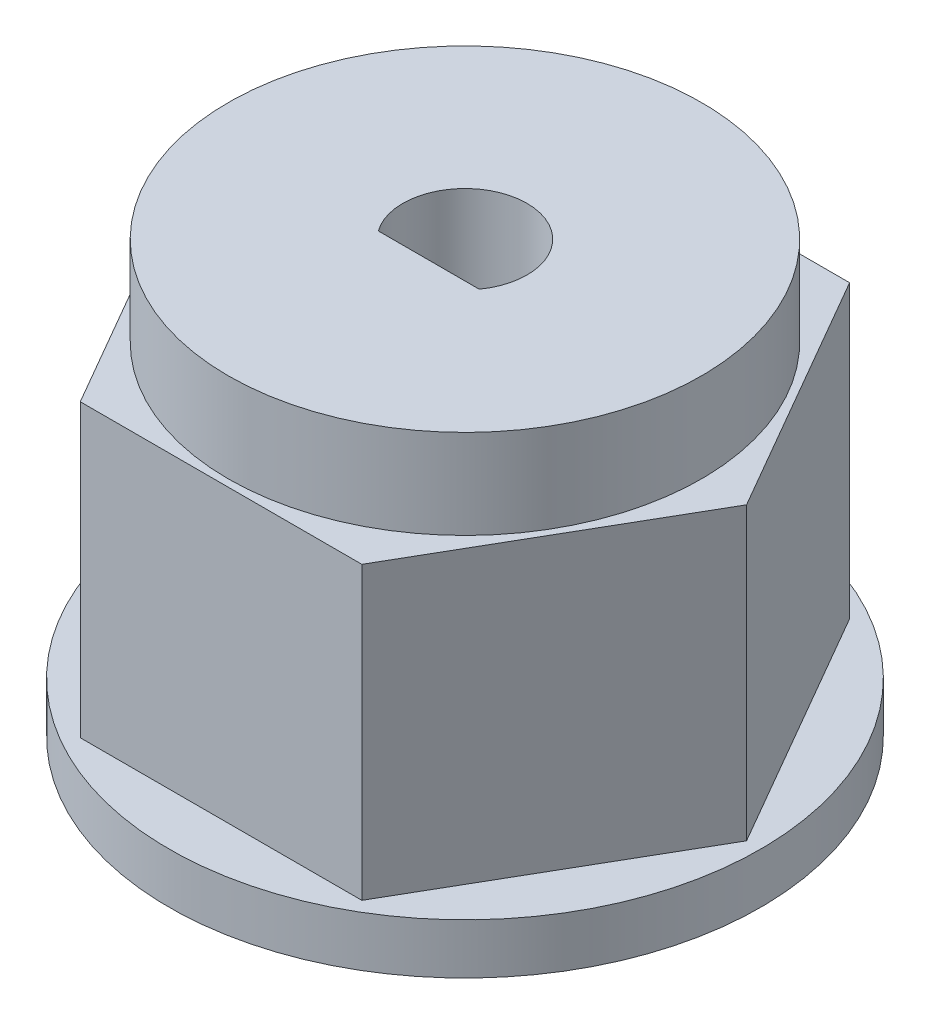
ISO-10303-21;
HEADER;
FILE_DESCRIPTION(('STEP AP214'),'2;1');
FILE_NAME('part.step','',(''),(''),'','','');
FILE_SCHEMA(('AUTOMOTIVE_DESIGN { 1 0 10303 214 1 1 1 1 }'));
ENDSEC;
DATA;
#1=APPLICATION_CONTEXT('core data for automotive mechanical design processes');
#2=APPLICATION_PROTOCOL_DEFINITION('international standard','automotive_design',2000,#1);
#3=PRODUCT_CONTEXT('',#1,'mechanical');
#4=PRODUCT('Part','Part','',(#3));
#5=PRODUCT_RELATED_PRODUCT_CATEGORY('part','',(#4));
#6=PRODUCT_DEFINITION_FORMATION('','',#4);
#7=PRODUCT_DEFINITION_CONTEXT('part definition',#1,'design');
#8=PRODUCT_DEFINITION('design','',#6,#7);
#9=PRODUCT_DEFINITION_SHAPE('','',#8);
#10=(LENGTH_UNIT() NAMED_UNIT(*) SI_UNIT(.MILLI.,.METRE.));
#11=(NAMED_UNIT(*) PLANE_ANGLE_UNIT() SI_UNIT($,.RADIAN.));
#12=(NAMED_UNIT(*) SI_UNIT($,.STERADIAN.) SOLID_ANGLE_UNIT());
#13=UNCERTAINTY_MEASURE_WITH_UNIT(LENGTH_MEASURE(1.E-05),#10,'distance_accuracy_value','');
#14=(GEOMETRIC_REPRESENTATION_CONTEXT(3) GLOBAL_UNCERTAINTY_ASSIGNED_CONTEXT((#13)) GLOBAL_UNIT_ASSIGNED_CONTEXT((#10,
#11,#12)) REPRESENTATION_CONTEXT('',''));
#15=CARTESIAN_POINT('',(0.,0.,0.));
#16=DIRECTION('',(0.,0.,1.));
#17=DIRECTION('',(1.,0.,0.));
#18=AXIS2_PLACEMENT_3D('',#15,#16,#17);
#19=CARTESIAN_POINT('',(3.62864644185677,7.5,6.28499999999993));
#20=DIRECTION('',(-0.866025403784439,0.,-0.5));
#21=DIRECTION('',(-0.5,0.,0.866025403784439));
#22=AXIS2_PLACEMENT_3D('',#19,#20,#21);
#23=PLANE('',#22);
#24=DIRECTION('',(0.5,0.,-0.866025403784439));
#25=VECTOR('',#24,1.);
#26=CARTESIAN_POINT('',(3.62864644185677,0.,6.28499999999993));
#27=LINE('',#26,#25);
#28=CARTESIAN_POINT('',(3.62864644185677,0.,6.28499999999993));
#29=VERTEX_POINT('',#28);
#30=CARTESIAN_POINT('',(7.25729288371349,0.,0.));
#31=VERTEX_POINT('',#30);
#32=EDGE_CURVE('E123',#29,#31,#27,.T.);
#33=ORIENTED_EDGE('',*,*,#32,.T.);
#34=DIRECTION('',(0.,-1.,0.));
#35=VECTOR('',#34,1.);
#36=CARTESIAN_POINT('',(7.25729288371349,7.5,0.));
#37=LINE('',#36,#35);
#38=CARTESIAN_POINT('',(7.25729288371349,7.5,0.));
#39=VERTEX_POINT('',#38);
#40=EDGE_CURVE('E36',#39,#31,#37,.T.);
#41=ORIENTED_EDGE('',*,*,#40,.F.);
#42=DIRECTION('',(0.5,0.,-0.866025403784439));
#43=VECTOR('',#42,1.);
#44=CARTESIAN_POINT('',(3.62864644185677,7.5,6.28499999999993));
#45=LINE('',#44,#43);
#46=CARTESIAN_POINT('',(3.62864644185677,7.5,6.28499999999993));
#47=VERTEX_POINT('',#46);
#48=EDGE_CURVE('E125',#47,#39,#45,.T.);
#49=ORIENTED_EDGE('',*,*,#48,.F.);
#50=DIRECTION('',(0.,-1.,0.));
#51=VECTOR('',#50,1.);
#52=CARTESIAN_POINT('',(3.62864644185677,7.5,6.28499999999993));
#53=LINE('',#52,#51);
#54=EDGE_CURVE('E139',#47,#29,#53,.T.);
#55=ORIENTED_EDGE('',*,*,#54,.T.);
#56=EDGE_LOOP('',(#33,#41,#49,#55));
#57=FACE_BOUND('',#56,.T.);
#58=ADVANCED_FACE('F33',(#57),#23,.F.);
#59=CARTESIAN_POINT('',(7.25729288371349,7.5,0.));
#60=DIRECTION('',(-0.866025403784439,0.,0.5));
#61=DIRECTION('',(0.5,0.,0.866025403784439));
#62=AXIS2_PLACEMENT_3D('',#59,#60,#61);
#63=PLANE('',#62);
#64=DIRECTION('',(-0.5,0.,-0.866025403784439));
#65=VECTOR('',#64,1.);
#66=CARTESIAN_POINT('',(7.25729288371349,0.,0.));
#67=LINE('',#66,#65);
#68=CARTESIAN_POINT('',(3.62864644185665,0.,-6.28500000000001));
#69=VERTEX_POINT('',#68);
#70=EDGE_CURVE('E142',#31,#69,#67,.T.);
#71=ORIENTED_EDGE('',*,*,#70,.T.);
#72=DIRECTION('',(0.,-1.,0.));
#73=VECTOR('',#72,1.);
#74=CARTESIAN_POINT('',(3.62864644185665,7.5,-6.28500000000001));
#75=LINE('',#74,#73);
#76=CARTESIAN_POINT('',(3.62864644185665,7.5,-6.28500000000001));
#77=VERTEX_POINT('',#76);
#78=EDGE_CURVE('E166',#77,#69,#75,.T.);
#79=ORIENTED_EDGE('',*,*,#78,.F.);
#80=DIRECTION('',(-0.5,0.,-0.866025403784439));
#81=VECTOR('',#80,1.);
#82=CARTESIAN_POINT('',(7.25729288371349,7.5,0.));
#83=LINE('',#82,#81);
#84=EDGE_CURVE('E128',#39,#77,#83,.T.);
#85=ORIENTED_EDGE('',*,*,#84,.F.);
#86=ORIENTED_EDGE('',*,*,#40,.T.);
#87=EDGE_LOOP('',(#71,#79,#85,#86));
#88=FACE_BOUND('',#87,.T.);
#89=ADVANCED_FACE('F174',(#88),#63,.F.);
#90=CARTESIAN_POINT('',(3.62864644185665,7.5,-6.28500000000001));
#91=DIRECTION('',(0.,0.,1.));
#92=DIRECTION('',(1.,0.,0.));
#93=AXIS2_PLACEMENT_3D('',#90,#91,#92);
#94=PLANE('',#93);
#95=DIRECTION('',(-1.,0.,0.));
#96=VECTOR('',#95,1.);
#97=CARTESIAN_POINT('',(3.62864644185665,0.,-6.28500000000001));
#98=LINE('',#97,#96);
#99=CARTESIAN_POINT('',(-3.62864644185681,0.,-6.28500000000001));
#100=VERTEX_POINT('',#99);
#101=EDGE_CURVE('E145',#69,#100,#98,.T.);
#102=ORIENTED_EDGE('',*,*,#101,.T.);
#103=DIRECTION('',(0.,-1.,0.));
#104=VECTOR('',#103,1.);
#105=CARTESIAN_POINT('',(-3.62864644185681,7.5,-6.28500000000001));
#106=LINE('',#105,#104);
#107=CARTESIAN_POINT('',(-3.62864644185681,7.5,-6.28500000000001));
#108=VERTEX_POINT('',#107);
#109=EDGE_CURVE('E164',#108,#100,#106,.T.);
#110=ORIENTED_EDGE('',*,*,#109,.F.);
#111=DIRECTION('',(-1.,0.,0.));
#112=VECTOR('',#111,1.);
#113=CARTESIAN_POINT('',(3.62864644185665,7.5,-6.28500000000001));
#114=LINE('',#113,#112);
#115=EDGE_CURVE('E131',#77,#108,#114,.T.);
#116=ORIENTED_EDGE('',*,*,#115,.F.);
#117=ORIENTED_EDGE('',*,*,#78,.T.);
#118=EDGE_LOOP('',(#102,#110,#116,#117));
#119=FACE_BOUND('',#118,.T.);
#120=ADVANCED_FACE('F193',(#119),#94,.F.);
#121=CARTESIAN_POINT('',(-3.62864644185681,7.5,-6.28500000000001));
#122=DIRECTION('',(0.866025403784438,0.,0.500000000000001));
#123=DIRECTION('',(0.500000000000001,0.,-0.866025403784438));
#124=AXIS2_PLACEMENT_3D('',#121,#122,#123);
#125=PLANE('',#124);
#126=DIRECTION('',(-0.500000000000001,0.,0.866025403784438));
#127=VECTOR('',#126,1.);
#128=CARTESIAN_POINT('',(-3.62864644185681,0.,-6.28500000000001));
#129=LINE('',#128,#127);
#130=CARTESIAN_POINT('',(-7.25729288371363,0.,0.));
#131=VERTEX_POINT('',#130);
#132=EDGE_CURVE('E148',#100,#131,#129,.T.);
#133=ORIENTED_EDGE('',*,*,#132,.T.);
#134=DIRECTION('',(0.,-1.,0.));
#135=VECTOR('',#134,1.);
#136=CARTESIAN_POINT('',(-7.25729288371363,7.5,0.));
#137=LINE('',#136,#135);
#138=CARTESIAN_POINT('',(-7.25729288371363,7.5,0.));
#139=VERTEX_POINT('',#138);
#140=EDGE_CURVE('E161',#139,#131,#137,.T.);
#141=ORIENTED_EDGE('',*,*,#140,.F.);
#142=DIRECTION('',(-0.500000000000001,0.,0.866025403784438));
#143=VECTOR('',#142,1.);
#144=CARTESIAN_POINT('',(-3.62864644185681,7.5,-6.28500000000001));
#145=LINE('',#144,#143);
#146=EDGE_CURVE('E133',#108,#139,#145,.T.);
#147=ORIENTED_EDGE('',*,*,#146,.F.);
#148=ORIENTED_EDGE('',*,*,#109,.T.);
#149=EDGE_LOOP('',(#133,#141,#147,#148));
#150=FACE_BOUND('',#149,.T.);
#151=ADVANCED_FACE('F190',(#150),#125,.F.);
#152=CARTESIAN_POINT('',(-7.25729288371363,7.5,0.));
#153=DIRECTION('',(0.866025403784439,0.,-0.499999999999999));
#154=DIRECTION('',(-0.499999999999999,0.,-0.866025403784439));
#155=AXIS2_PLACEMENT_3D('',#152,#153,#154);
#156=PLANE('',#155);
#157=DIRECTION('',(0.499999999999999,0.,0.866025403784439));
#158=VECTOR('',#157,1.);
#159=CARTESIAN_POINT('',(-7.25729288371363,0.,0.));
#160=LINE('',#159,#158);
#161=CARTESIAN_POINT('',(-3.62864644185686,0.,6.28499999999996));
#162=VERTEX_POINT('',#161);
#163=EDGE_CURVE('E151',#131,#162,#160,.T.);
#164=ORIENTED_EDGE('',*,*,#163,.T.);
#165=DIRECTION('',(0.,-1.,0.));
#166=VECTOR('',#165,1.);
#167=CARTESIAN_POINT('',(-3.62864644185686,7.5,6.28499999999996));
#168=LINE('',#167,#166);
#169=CARTESIAN_POINT('',(-3.62864644185686,7.5,6.28499999999996));
#170=VERTEX_POINT('',#169);
#171=EDGE_CURVE('E158',#170,#162,#168,.T.);
#172=ORIENTED_EDGE('',*,*,#171,.F.);
#173=DIRECTION('',(0.499999999999999,0.,0.866025403784439));
#174=VECTOR('',#173,1.);
#175=CARTESIAN_POINT('',(-7.25729288371363,7.5,0.));
#176=LINE('',#175,#174);
#177=EDGE_CURVE('E135',#139,#170,#176,.T.);
#178=ORIENTED_EDGE('',*,*,#177,.F.);
#179=ORIENTED_EDGE('',*,*,#140,.T.);
#180=EDGE_LOOP('',(#164,#172,#178,#179));
#181=FACE_BOUND('',#180,.T.);
#182=ADVANCED_FACE('F187',(#181),#156,.F.);
#183=CARTESIAN_POINT('',(-3.62864644185686,7.5,6.28499999999996));
#184=DIRECTION('',(0.,0.,-1.));
#185=DIRECTION('',(-1.,0.,0.));
#186=AXIS2_PLACEMENT_3D('',#183,#184,#185);
#187=PLANE('',#186);
#188=DIRECTION('',(1.,0.,0.));
#189=VECTOR('',#188,1.);
#190=CARTESIAN_POINT('',(-3.62864644185686,0.,6.28499999999996));
#191=LINE('',#190,#189);
#192=EDGE_CURVE('E129',#162,#29,#191,.T.);
#193=ORIENTED_EDGE('',*,*,#192,.T.);
#194=ORIENTED_EDGE('',*,*,#54,.F.);
#195=DIRECTION('',(1.,0.,0.));
#196=VECTOR('',#195,1.);
#197=CARTESIAN_POINT('',(-3.62864644185686,7.5,6.28499999999996));
#198=LINE('',#197,#196);
#199=EDGE_CURVE('E137',#170,#47,#198,.T.);
#200=ORIENTED_EDGE('',*,*,#199,.F.);
#201=ORIENTED_EDGE('',*,*,#171,.T.);
#202=EDGE_LOOP('',(#193,#194,#200,#201));
#203=FACE_BOUND('',#202,.T.);
#204=ADVANCED_FACE('F182',(#203),#187,.F.);
#205=CARTESIAN_POINT('',(0.,7.5,0.));
#206=DIRECTION('',(0.,1.,0.));
#207=DIRECTION('',(0.,0.,1.));
#208=AXIS2_PLACEMENT_3D('',#205,#206,#207);
#209=PLANE('',#208);
#210=CARTESIAN_POINT('',(0.,7.5,0.));
#211=DIRECTION('',(0.,1.,0.));
#212=DIRECTION('',(0.,0.,1.));
#213=AXIS2_PLACEMENT_3D('',#210,#211,#212);
#214=CIRCLE('',#213,6.1);
#215=CARTESIAN_POINT('',(0.,7.5,6.1));
#216=VERTEX_POINT('',#215);
#217=EDGE_CURVE('E11',#216,#216,#214,.T.);
#218=ORIENTED_EDGE('',*,*,#217,.F.);
#219=EDGE_LOOP('',(#218));
#220=FACE_BOUND('',#219,.T.);
#221=ORIENTED_EDGE('',*,*,#48,.T.);
#222=ORIENTED_EDGE('',*,*,#84,.T.);
#223=ORIENTED_EDGE('',*,*,#115,.T.);
#224=ORIENTED_EDGE('',*,*,#146,.T.);
#225=ORIENTED_EDGE('',*,*,#177,.T.);
#226=ORIENTED_EDGE('',*,*,#199,.T.);
#227=EDGE_LOOP('',(#221,#222,#223,#224,#225,#226));
#228=FACE_BOUND('',#227,.T.);
#229=ADVANCED_FACE('F195',(#220,#228),#209,.T.);
#230=CARTESIAN_POINT('',(0.,9.8,0.));
#231=DIRECTION('',(0.,-1.,0.));
#232=DIRECTION('',(0.,0.,-1.));
#233=AXIS2_PLACEMENT_3D('',#230,#231,#232);
#234=CYLINDRICAL_SURFACE('',#233,6.1);
#235=CARTESIAN_POINT('',(0.,9.8,0.));
#236=DIRECTION('',(0.,1.,0.));
#237=DIRECTION('',(0.,0.,1.));
#238=AXIS2_PLACEMENT_3D('',#235,#236,#237);
#239=CIRCLE('',#238,6.1);
#240=CARTESIAN_POINT('',(0.,9.8,6.1));
#241=VERTEX_POINT('',#240);
#242=EDGE_CURVE('E119',#241,#241,#239,.T.);
#243=ORIENTED_EDGE('',*,*,#242,.F.);
#244=EDGE_LOOP('',(#243));
#245=FACE_BOUND('',#244,.T.);
#246=ORIENTED_EDGE('',*,*,#217,.T.);
#247=EDGE_LOOP('',(#246));
#248=FACE_BOUND('',#247,.T.);
#249=ADVANCED_FACE('F197',(#245,#248),#234,.T.);
#250=CARTESIAN_POINT('',(0.,9.8,0.));
#251=DIRECTION('',(0.,1.,0.));
#252=DIRECTION('',(0.,0.,1.));
#253=AXIS2_PLACEMENT_3D('',#250,#251,#252);
#254=PLANE('',#253);
#255=CARTESIAN_POINT('',(0.,9.8,0.));
#256=DIRECTION('',(0.,1.,0.));
#257=DIRECTION('',(0.,0.,1.));
#258=AXIS2_PLACEMENT_3D('',#255,#256,#257);
#259=CIRCLE('',#258,1.6);
#260=CARTESIAN_POINT('',(1.3,9.8,0.932737905308882));
#261=VERTEX_POINT('',#260);
#262=CARTESIAN_POINT('',(-1.3,9.8,0.932737905308882));
#263=VERTEX_POINT('',#262);
#264=EDGE_CURVE('E48',#261,#263,#259,.T.);
#265=ORIENTED_EDGE('',*,*,#264,.F.);
#266=DIRECTION('',(1.,0.,0.));
#267=VECTOR('',#266,1.);
#268=CARTESIAN_POINT('',(-1.3,9.8,0.932737905308882));
#269=LINE('',#268,#267);
#270=EDGE_CURVE('E109',#263,#261,#269,.T.);
#271=ORIENTED_EDGE('',*,*,#270,.F.);
#272=EDGE_LOOP('',(#265,#271));
#273=FACE_BOUND('',#272,.T.);
#274=ORIENTED_EDGE('',*,*,#242,.T.);
#275=EDGE_LOOP('',(#274));
#276=FACE_BOUND('',#275,.T.);
#277=ADVANCED_FACE('F204',(#273,#276),#254,.T.);
#278=CARTESIAN_POINT('',(0.,-1.3,0.));
#279=DIRECTION('',(0.,1.,0.));
#280=DIRECTION('',(0.,0.,1.));
#281=AXIS2_PLACEMENT_3D('',#278,#279,#280);
#282=CYLINDRICAL_SURFACE('',#281,7.625);
#283=CARTESIAN_POINT('',(0.,-1.3,0.));
#284=DIRECTION('',(0.,-1.,0.));
#285=DIRECTION('',(0.,0.,-1.));
#286=AXIS2_PLACEMENT_3D('',#283,#284,#285);
#287=CIRCLE('',#286,7.625);
#288=CARTESIAN_POINT('',(0.,-1.3,-7.625));
#289=VERTEX_POINT('',#288);
#290=EDGE_CURVE('E116',#289,#289,#287,.T.);
#291=ORIENTED_EDGE('',*,*,#290,.F.);
#292=EDGE_LOOP('',(#291));
#293=FACE_BOUND('',#292,.T.);
#294=CARTESIAN_POINT('',(0.,0.,0.));
#295=DIRECTION('',(0.,-1.,0.));
#296=DIRECTION('',(0.,0.,-1.));
#297=AXIS2_PLACEMENT_3D('',#294,#295,#296);
#298=CIRCLE('',#297,7.625);
#299=CARTESIAN_POINT('',(0.,0.,-7.625));
#300=VERTEX_POINT('',#299);
#301=EDGE_CURVE('E114',#300,#300,#298,.T.);
#302=ORIENTED_EDGE('',*,*,#301,.T.);
#303=EDGE_LOOP('',(#302));
#304=FACE_BOUND('',#303,.T.);
#305=ADVANCED_FACE('F235',(#293,#304),#282,.T.);
#306=CARTESIAN_POINT('',(0.,-1.3,0.));
#307=DIRECTION('',(0.,-1.,0.));
#308=DIRECTION('',(0.,0.,-1.));
#309=AXIS2_PLACEMENT_3D('',#306,#307,#308);
#310=PLANE('',#309);
#311=CARTESIAN_POINT('',(0.,-1.3,0.));
#312=DIRECTION('',(0.,1.,0.));
#313=DIRECTION('',(0.,0.,1.));
#314=AXIS2_PLACEMENT_3D('',#311,#312,#313);
#315=CIRCLE('',#314,1.6);
#316=CARTESIAN_POINT('',(1.3,-1.3,0.932737905308882));
#317=VERTEX_POINT('',#316);
#318=CARTESIAN_POINT('',(-1.3,-1.3,0.932737905308882));
#319=VERTEX_POINT('',#318);
#320=EDGE_CURVE('E53',#317,#319,#315,.T.);
#321=ORIENTED_EDGE('',*,*,#320,.T.);
#322=DIRECTION('',(1.,0.,0.));
#323=VECTOR('',#322,1.);
#324=CARTESIAN_POINT('',(-1.3,-1.3,0.932737905308882));
#325=LINE('',#324,#323);
#326=EDGE_CURVE('E101',#319,#317,#325,.T.);
#327=ORIENTED_EDGE('',*,*,#326,.T.);
#328=EDGE_LOOP('',(#321,#327));
#329=FACE_BOUND('',#328,.T.);
#330=ORIENTED_EDGE('',*,*,#290,.T.);
#331=EDGE_LOOP('',(#330));
#332=FACE_BOUND('',#331,.T.);
#333=ADVANCED_FACE('F107',(#329,#332),#310,.T.);
#334=CARTESIAN_POINT('',(0.,0.,0.));
#335=DIRECTION('',(0.,-1.,0.));
#336=DIRECTION('',(0.,0.,-1.));
#337=AXIS2_PLACEMENT_3D('',#334,#335,#336);
#338=PLANE('',#337);
#339=ORIENTED_EDGE('',*,*,#32,.F.);
#340=ORIENTED_EDGE('',*,*,#192,.F.);
#341=ORIENTED_EDGE('',*,*,#163,.F.);
#342=ORIENTED_EDGE('',*,*,#132,.F.);
#343=ORIENTED_EDGE('',*,*,#101,.F.);
#344=ORIENTED_EDGE('',*,*,#70,.F.);
#345=EDGE_LOOP('',(#339,#340,#341,#342,#343,#344));
#346=FACE_BOUND('',#345,.T.);
#347=ORIENTED_EDGE('',*,*,#301,.F.);
#348=EDGE_LOOP('',(#347));
#349=FACE_BOUND('',#348,.T.);
#350=ADVANCED_FACE('F179',(#346,#349),#338,.F.);
#351=CARTESIAN_POINT('',(0.,-1.3,0.));
#352=DIRECTION('',(0.,1.,0.));
#353=DIRECTION('',(0.,0.,1.));
#354=AXIS2_PLACEMENT_3D('',#351,#352,#353);
#355=CYLINDRICAL_SURFACE('',#354,1.6);
#356=ORIENTED_EDGE('',*,*,#264,.T.);
#357=DIRECTION('',(0.,1.,0.));
#358=VECTOR('',#357,1.);
#359=CARTESIAN_POINT('',(-1.3,-1.3,0.932737905308882));
#360=LINE('',#359,#358);
#361=EDGE_CURVE('E94',#319,#263,#360,.T.);
#362=ORIENTED_EDGE('',*,*,#361,.F.);
#363=ORIENTED_EDGE('',*,*,#320,.F.);
#364=DIRECTION('',(0.,1.,0.));
#365=VECTOR('',#364,1.);
#366=CARTESIAN_POINT('',(1.3,-1.3,0.932737905308882));
#367=LINE('',#366,#365);
#368=EDGE_CURVE('E100',#317,#261,#367,.T.);
#369=ORIENTED_EDGE('',*,*,#368,.T.);
#370=EDGE_LOOP('',(#356,#362,#363,#369));
#371=FACE_BOUND('',#370,.T.);
#372=ADVANCED_FACE('F96',(#371),#355,.F.);
#373=CARTESIAN_POINT('',(-1.3,-1.3,0.932737905308882));
#374=DIRECTION('',(0.,0.,1.));
#375=DIRECTION('',(1.,0.,0.));
#376=AXIS2_PLACEMENT_3D('',#373,#374,#375);
#377=PLANE('',#376);
#378=ORIENTED_EDGE('',*,*,#270,.T.);
#379=ORIENTED_EDGE('',*,*,#368,.F.);
#380=ORIENTED_EDGE('',*,*,#326,.F.);
#381=ORIENTED_EDGE('',*,*,#361,.T.);
#382=EDGE_LOOP('',(#378,#379,#380,#381));
#383=FACE_BOUND('',#382,.T.);
#384=ADVANCED_FACE('F104',(#383),#377,.F.);
#385=CLOSED_SHELL('',(#58,#89,#120,#151,#182,#204,#229,#249,#277,#305,#333,#350,#372,#384));
#386=MANIFOLD_SOLID_BREP('B2',#385);
#387=ADVANCED_BREP_SHAPE_REPRESENTATION('',(#18,#386),#14);
#388=SHAPE_DEFINITION_REPRESENTATION(#9,#387);
ENDSEC;
END-ISO-10303-21;
